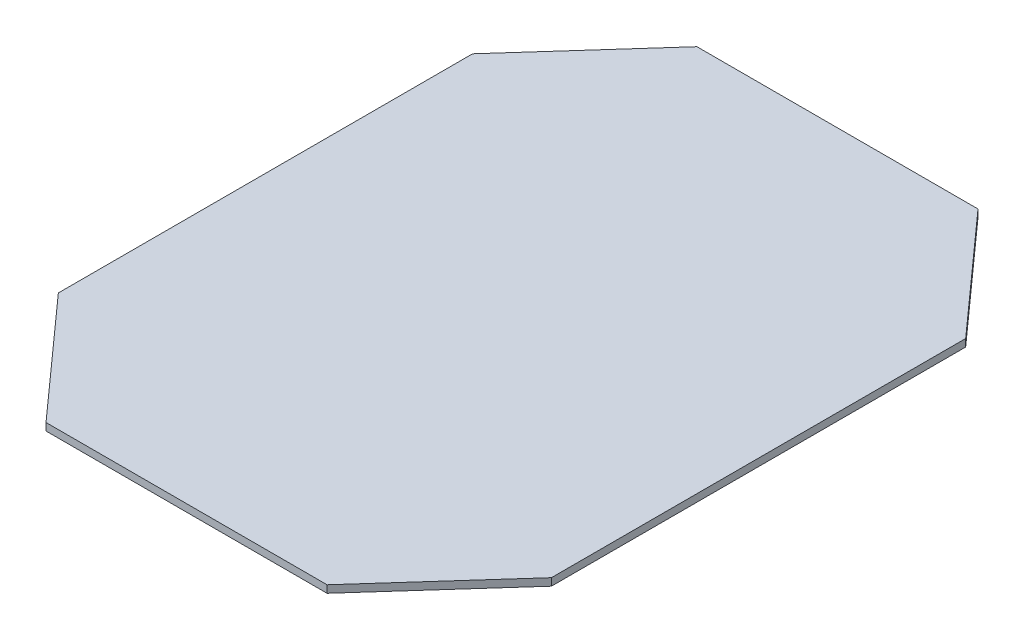
ISO-10303-21;
HEADER;
FILE_DESCRIPTION(('STEP AP214'),'2;1');
FILE_NAME('part.step','',(''),(''),'','','');
FILE_SCHEMA(('AUTOMOTIVE_DESIGN { 1 0 10303 214 1 1 1 1 }'));
ENDSEC;
DATA;
#1=APPLICATION_CONTEXT('core data for automotive mechanical design processes');
#2=APPLICATION_PROTOCOL_DEFINITION('international standard','automotive_design',2000,#1);
#3=PRODUCT_CONTEXT('',#1,'mechanical');
#4=PRODUCT('Part','Part','',(#3));
#5=PRODUCT_RELATED_PRODUCT_CATEGORY('part','',(#4));
#6=PRODUCT_DEFINITION_FORMATION('','',#4);
#7=PRODUCT_DEFINITION_CONTEXT('part definition',#1,'design');
#8=PRODUCT_DEFINITION('design','',#6,#7);
#9=PRODUCT_DEFINITION_SHAPE('','',#8);
#10=(LENGTH_UNIT() NAMED_UNIT(*) SI_UNIT(.MILLI.,.METRE.));
#11=(NAMED_UNIT(*) PLANE_ANGLE_UNIT() SI_UNIT($,.RADIAN.));
#12=(NAMED_UNIT(*) SI_UNIT($,.STERADIAN.) SOLID_ANGLE_UNIT());
#13=UNCERTAINTY_MEASURE_WITH_UNIT(LENGTH_MEASURE(1.E-05),#10,'distance_accuracy_value','');
#14=(GEOMETRIC_REPRESENTATION_CONTEXT(3) GLOBAL_UNCERTAINTY_ASSIGNED_CONTEXT((#13)) GLOBAL_UNIT_ASSIGNED_CONTEXT((#10,
#11,#12)) REPRESENTATION_CONTEXT('',''));
#15=CARTESIAN_POINT('',(0.,0.,0.));
#16=DIRECTION('',(0.,0.,1.));
#17=DIRECTION('',(1.,0.,0.));
#18=AXIS2_PLACEMENT_3D('',#15,#16,#17);
#19=CARTESIAN_POINT('',(0.,1.5,0.));
#20=DIRECTION('',(1.,0.,0.));
#21=DIRECTION('',(0.,0.,-1.));
#22=AXIS2_PLACEMENT_3D('',#19,#20,#21);
#23=PLANE('',#22);
#24=DIRECTION('',(0.,0.,1.));
#25=VECTOR('',#24,1.);
#26=CARTESIAN_POINT('',(0.,0.,0.));
#27=LINE('',#26,#25);
#28=CARTESIAN_POINT('',(0.,0.,-108.));
#29=VERTEX_POINT('',#28);
#30=CARTESIAN_POINT('',(0.,0.,-23.9999999999999));
#31=VERTEX_POINT('',#30);
#32=EDGE_CURVE('E129',#29,#31,#27,.T.);
#33=ORIENTED_EDGE('',*,*,#32,.T.);
#34=DIRECTION('',(0.,1.,0.));
#35=VECTOR('',#34,1.);
#36=CARTESIAN_POINT('',(0.,0.,-24.));
#37=LINE('',#36,#35);
#38=CARTESIAN_POINT('',(0.,1.5,-24.));
#39=VERTEX_POINT('',#38);
#40=EDGE_CURVE('E145',#31,#39,#37,.T.);
#41=ORIENTED_EDGE('',*,*,#40,.T.);
#42=DIRECTION('',(0.,0.,1.));
#43=VECTOR('',#42,1.);
#44=CARTESIAN_POINT('',(0.,1.5,0.));
#45=LINE('',#44,#43);
#46=CARTESIAN_POINT('',(0.,1.5,-108.));
#47=VERTEX_POINT('',#46);
#48=EDGE_CURVE('E120',#47,#39,#45,.T.);
#49=ORIENTED_EDGE('',*,*,#48,.F.);
#50=DIRECTION('',(0.,1.,0.));
#51=VECTOR('',#50,1.);
#52=CARTESIAN_POINT('',(0.,0.,-108.));
#53=LINE('',#52,#51);
#54=EDGE_CURVE('E139',#29,#47,#53,.T.);
#55=ORIENTED_EDGE('',*,*,#54,.F.);
#56=EDGE_LOOP('',(#33,#41,#49,#55));
#57=FACE_BOUND('',#56,.T.);
#58=ADVANCED_FACE('F35',(#57),#23,.F.);
#59=CARTESIAN_POINT('',(0.,1.5,0.));
#60=DIRECTION('',(0.,0.,-1.));
#61=DIRECTION('',(-1.,0.,0.));
#62=AXIS2_PLACEMENT_3D('',#59,#60,#61);
#63=PLANE('',#62);
#64=DIRECTION('',(1.,0.,0.));
#65=VECTOR('',#64,1.);
#66=CARTESIAN_POINT('',(0.,1.5,0.));
#67=LINE('',#66,#65);
#68=CARTESIAN_POINT('',(21.5,1.5,0.));
#69=VERTEX_POINT('',#68);
#70=CARTESIAN_POINT('',(78.5,1.5,0.));
#71=VERTEX_POINT('',#70);
#72=EDGE_CURVE('E123',#69,#71,#67,.T.);
#73=ORIENTED_EDGE('',*,*,#72,.F.);
#74=DIRECTION('',(0.,1.,0.));
#75=VECTOR('',#74,1.);
#76=CARTESIAN_POINT('',(21.5,0.,0.));
#77=LINE('',#76,#75);
#78=CARTESIAN_POINT('',(21.5,0.,0.));
#79=VERTEX_POINT('',#78);
#80=EDGE_CURVE('E148',#79,#69,#77,.T.);
#81=ORIENTED_EDGE('',*,*,#80,.F.);
#82=DIRECTION('',(1.,0.,0.));
#83=VECTOR('',#82,1.);
#84=CARTESIAN_POINT('',(0.,0.,0.));
#85=LINE('',#84,#83);
#86=CARTESIAN_POINT('',(78.5,0.,0.));
#87=VERTEX_POINT('',#86);
#88=EDGE_CURVE('E125',#79,#87,#85,.T.);
#89=ORIENTED_EDGE('',*,*,#88,.T.);
#90=DIRECTION('',(0.,1.,0.));
#91=VECTOR('',#90,1.);
#92=CARTESIAN_POINT('',(78.5,0.,0.));
#93=LINE('',#92,#91);
#94=EDGE_CURVE('E51',#87,#71,#93,.T.);
#95=ORIENTED_EDGE('',*,*,#94,.T.);
#96=EDGE_LOOP('',(#73,#81,#89,#95));
#97=FACE_BOUND('',#96,.T.);
#98=ADVANCED_FACE('F171',(#97),#63,.F.);
#99=CARTESIAN_POINT('',(100.,1.5,0.));
#100=DIRECTION('',(-1.,0.,0.));
#101=DIRECTION('',(0.,0.,1.));
#102=AXIS2_PLACEMENT_3D('',#99,#100,#101);
#103=PLANE('',#102);
#104=DIRECTION('',(0.,0.,-1.));
#105=VECTOR('',#104,1.);
#106=CARTESIAN_POINT('',(100.,1.5,0.));
#107=LINE('',#106,#105);
#108=CARTESIAN_POINT('',(100.,1.5,-24.));
#109=VERTEX_POINT('',#108);
#110=CARTESIAN_POINT('',(100.,1.5,-108.));
#111=VERTEX_POINT('',#110);
#112=EDGE_CURVE('E43',#109,#111,#107,.T.);
#113=ORIENTED_EDGE('',*,*,#112,.F.);
#114=DIRECTION('',(0.,1.,0.));
#115=VECTOR('',#114,1.);
#116=CARTESIAN_POINT('',(100.,0.,-24.));
#117=LINE('',#116,#115);
#118=CARTESIAN_POINT('',(100.,0.,-24.));
#119=VERTEX_POINT('',#118);
#120=EDGE_CURVE('E155',#119,#109,#117,.T.);
#121=ORIENTED_EDGE('',*,*,#120,.F.);
#122=DIRECTION('',(0.,0.,-1.));
#123=VECTOR('',#122,1.);
#124=CARTESIAN_POINT('',(100.,0.,0.));
#125=LINE('',#124,#123);
#126=CARTESIAN_POINT('',(100.,0.,-108.));
#127=VERTEX_POINT('',#126);
#128=EDGE_CURVE('E121',#119,#127,#125,.T.);
#129=ORIENTED_EDGE('',*,*,#128,.T.);
#130=DIRECTION('',(0.,1.,0.));
#131=VECTOR('',#130,1.);
#132=CARTESIAN_POINT('',(100.,0.,-108.));
#133=LINE('',#132,#131);
#134=EDGE_CURVE('E59',#127,#111,#133,.T.);
#135=ORIENTED_EDGE('',*,*,#134,.T.);
#136=EDGE_LOOP('',(#113,#121,#129,#135));
#137=FACE_BOUND('',#136,.T.);
#138=ADVANCED_FACE('F164',(#137),#103,.F.);
#139=CARTESIAN_POINT('',(0.,1.5,-132.));
#140=DIRECTION('',(0.,0.,1.));
#141=DIRECTION('',(1.,0.,0.));
#142=AXIS2_PLACEMENT_3D('',#139,#140,#141);
#143=PLANE('',#142);
#144=DIRECTION('',(-1.,0.,0.));
#145=VECTOR('',#144,1.);
#146=CARTESIAN_POINT('',(0.,1.5,-132.));
#147=LINE('',#146,#145);
#148=CARTESIAN_POINT('',(78.5,1.5,-132.));
#149=VERTEX_POINT('',#148);
#150=CARTESIAN_POINT('',(21.5,1.5,-132.));
#151=VERTEX_POINT('',#150);
#152=EDGE_CURVE('E11',#149,#151,#147,.T.);
#153=ORIENTED_EDGE('',*,*,#152,.F.);
#154=DIRECTION('',(0.,1.,0.));
#155=VECTOR('',#154,1.);
#156=CARTESIAN_POINT('',(78.5,0.,-132.));
#157=LINE('',#156,#155);
#158=CARTESIAN_POINT('',(78.5,0.,-132.));
#159=VERTEX_POINT('',#158);
#160=EDGE_CURVE('E101',#159,#149,#157,.T.);
#161=ORIENTED_EDGE('',*,*,#160,.F.);
#162=DIRECTION('',(-1.,0.,0.));
#163=VECTOR('',#162,1.);
#164=CARTESIAN_POINT('',(0.,0.,-132.));
#165=LINE('',#164,#163);
#166=CARTESIAN_POINT('',(21.5,0.,-132.));
#167=VERTEX_POINT('',#166);
#168=EDGE_CURVE('E38',#159,#167,#165,.T.);
#169=ORIENTED_EDGE('',*,*,#168,.T.);
#170=DIRECTION('',(0.,1.,0.));
#171=VECTOR('',#170,1.);
#172=CARTESIAN_POINT('',(21.5,0.,-132.));
#173=LINE('',#172,#171);
#174=EDGE_CURVE('E133',#167,#151,#173,.T.);
#175=ORIENTED_EDGE('',*,*,#174,.T.);
#176=EDGE_LOOP('',(#153,#161,#169,#175));
#177=FACE_BOUND('',#176,.T.);
#178=ADVANCED_FACE('F112',(#177),#143,.F.);
#179=CARTESIAN_POINT('',(0.,1.5,0.));
#180=DIRECTION('',(0.,-1.,0.));
#181=DIRECTION('',(0.,0.,-1.));
#182=AXIS2_PLACEMENT_3D('',#179,#180,#181);
#183=PLANE('',#182);
#184=ORIENTED_EDGE('',*,*,#48,.T.);
#185=DIRECTION('',(-0.667248321585241,0.,-0.744835335723057));
#186=VECTOR('',#185,1.);
#187=CARTESIAN_POINT('',(21.5,1.5,0.));
#188=LINE('',#187,#186);
#189=EDGE_CURVE('E152',#69,#39,#188,.T.);
#190=ORIENTED_EDGE('',*,*,#189,.F.);
#191=ORIENTED_EDGE('',*,*,#72,.T.);
#192=DIRECTION('',(-0.667248321585241,0.,0.744835335723057));
#193=VECTOR('',#192,1.);
#194=CARTESIAN_POINT('',(78.5,1.5,0.));
#195=LINE('',#194,#193);
#196=EDGE_CURVE('E151',#109,#71,#195,.T.);
#197=ORIENTED_EDGE('',*,*,#196,.F.);
#198=ORIENTED_EDGE('',*,*,#112,.T.);
#199=DIRECTION('',(0.667248321585241,0.,0.744835335723057));
#200=VECTOR('',#199,1.);
#201=CARTESIAN_POINT('',(78.5,1.5,-132.));
#202=LINE('',#201,#200);
#203=EDGE_CURVE('E107',#149,#111,#202,.T.);
#204=ORIENTED_EDGE('',*,*,#203,.F.);
#205=ORIENTED_EDGE('',*,*,#152,.T.);
#206=DIRECTION('',(0.667248321585241,0.,-0.744835335723057));
#207=VECTOR('',#206,1.);
#208=CARTESIAN_POINT('',(21.5,1.5,-132.));
#209=LINE('',#208,#207);
#210=EDGE_CURVE('E142',#47,#151,#209,.T.);
#211=ORIENTED_EDGE('',*,*,#210,.F.);
#212=EDGE_LOOP('',(#184,#190,#191,#197,#198,#204,#205,#211));
#213=FACE_BOUND('',#212,.T.);
#214=ADVANCED_FACE('F166',(#213),#183,.F.);
#215=CARTESIAN_POINT('',(0.,0.,0.));
#216=DIRECTION('',(0.,-1.,0.));
#217=DIRECTION('',(0.,0.,-1.));
#218=AXIS2_PLACEMENT_3D('',#215,#216,#217);
#219=PLANE('',#218);
#220=DIRECTION('',(-0.667248321585241,0.,-0.744835335723057));
#221=VECTOR('',#220,1.);
#222=CARTESIAN_POINT('',(21.5,0.,0.));
#223=LINE('',#222,#221);
#224=EDGE_CURVE('E149',#79,#31,#223,.T.);
#225=ORIENTED_EDGE('',*,*,#224,.T.);
#226=ORIENTED_EDGE('',*,*,#32,.F.);
#227=DIRECTION('',(0.667248321585241,0.,-0.744835335723057));
#228=VECTOR('',#227,1.);
#229=CARTESIAN_POINT('',(21.5,0.,-132.));
#230=LINE('',#229,#228);
#231=EDGE_CURVE('E119',#29,#167,#230,.T.);
#232=ORIENTED_EDGE('',*,*,#231,.T.);
#233=ORIENTED_EDGE('',*,*,#168,.F.);
#234=DIRECTION('',(0.667248321585241,0.,0.744835335723057));
#235=VECTOR('',#234,1.);
#236=CARTESIAN_POINT('',(78.5,0.,-132.));
#237=LINE('',#236,#235);
#238=EDGE_CURVE('E98',#159,#127,#237,.T.);
#239=ORIENTED_EDGE('',*,*,#238,.T.);
#240=ORIENTED_EDGE('',*,*,#128,.F.);
#241=DIRECTION('',(-0.667248321585241,0.,0.744835335723057));
#242=VECTOR('',#241,1.);
#243=CARTESIAN_POINT('',(78.5,0.,0.));
#244=LINE('',#243,#242);
#245=EDGE_CURVE('E157',#119,#87,#244,.T.);
#246=ORIENTED_EDGE('',*,*,#245,.T.);
#247=ORIENTED_EDGE('',*,*,#88,.F.);
#248=EDGE_LOOP('',(#225,#226,#232,#233,#239,#240,#246,#247));
#249=FACE_BOUND('',#248,.T.);
#250=ADVANCED_FACE('F117',(#249),#219,.T.);
#251=CARTESIAN_POINT('',(21.5,0.,-132.));
#252=DIRECTION('',(0.744835335723057,0.,0.66724832158524));
#253=DIRECTION('',(0.667248321585241,0.,-0.744835335723057));
#254=AXIS2_PLACEMENT_3D('',#251,#252,#253);
#255=PLANE('',#254);
#256=ORIENTED_EDGE('',*,*,#210,.T.);
#257=ORIENTED_EDGE('',*,*,#174,.F.);
#258=ORIENTED_EDGE('',*,*,#231,.F.);
#259=ORIENTED_EDGE('',*,*,#54,.T.);
#260=EDGE_LOOP('',(#256,#257,#258,#259));
#261=FACE_BOUND('',#260,.T.);
#262=ADVANCED_FACE('F180',(#261),#255,.F.);
#263=CARTESIAN_POINT('',(78.5,0.,-132.));
#264=DIRECTION('',(-0.744835335723057,0.,0.66724832158524));
#265=DIRECTION('',(0.667248321585241,0.,0.744835335723057));
#266=AXIS2_PLACEMENT_3D('',#263,#264,#265);
#267=PLANE('',#266);
#268=ORIENTED_EDGE('',*,*,#203,.T.);
#269=ORIENTED_EDGE('',*,*,#134,.F.);
#270=ORIENTED_EDGE('',*,*,#238,.F.);
#271=ORIENTED_EDGE('',*,*,#160,.T.);
#272=EDGE_LOOP('',(#268,#269,#270,#271));
#273=FACE_BOUND('',#272,.T.);
#274=ADVANCED_FACE('F100',(#273),#267,.F.);
#275=CARTESIAN_POINT('',(78.5,0.,0.));
#276=DIRECTION('',(-0.744835335723057,0.,-0.66724832158524));
#277=DIRECTION('',(-0.667248321585241,0.,0.744835335723057));
#278=AXIS2_PLACEMENT_3D('',#275,#276,#277);
#279=PLANE('',#278);
#280=ORIENTED_EDGE('',*,*,#196,.T.);
#281=ORIENTED_EDGE('',*,*,#94,.F.);
#282=ORIENTED_EDGE('',*,*,#245,.F.);
#283=ORIENTED_EDGE('',*,*,#120,.T.);
#284=EDGE_LOOP('',(#280,#281,#282,#283));
#285=FACE_BOUND('',#284,.T.);
#286=ADVANCED_FACE('F169',(#285),#279,.F.);
#287=CARTESIAN_POINT('',(21.5,0.,0.));
#288=DIRECTION('',(0.744835335723057,0.,-0.66724832158524));
#289=DIRECTION('',(-0.667248321585241,0.,-0.744835335723057));
#290=AXIS2_PLACEMENT_3D('',#287,#288,#289);
#291=PLANE('',#290);
#292=ORIENTED_EDGE('',*,*,#189,.T.);
#293=ORIENTED_EDGE('',*,*,#40,.F.);
#294=ORIENTED_EDGE('',*,*,#224,.F.);
#295=ORIENTED_EDGE('',*,*,#80,.T.);
#296=EDGE_LOOP('',(#292,#293,#294,#295));
#297=FACE_BOUND('',#296,.T.);
#298=ADVANCED_FACE('F181',(#297),#291,.F.);
#299=CLOSED_SHELL('',(#58,#98,#138,#178,#214,#250,#262,#274,#286,#298));
#300=MANIFOLD_SOLID_BREP('B2',#299);
#301=ADVANCED_BREP_SHAPE_REPRESENTATION('',(#18,#300),#14);
#302=SHAPE_DEFINITION_REPRESENTATION(#9,#301);
ENDSEC;
END-ISO-10303-21;
